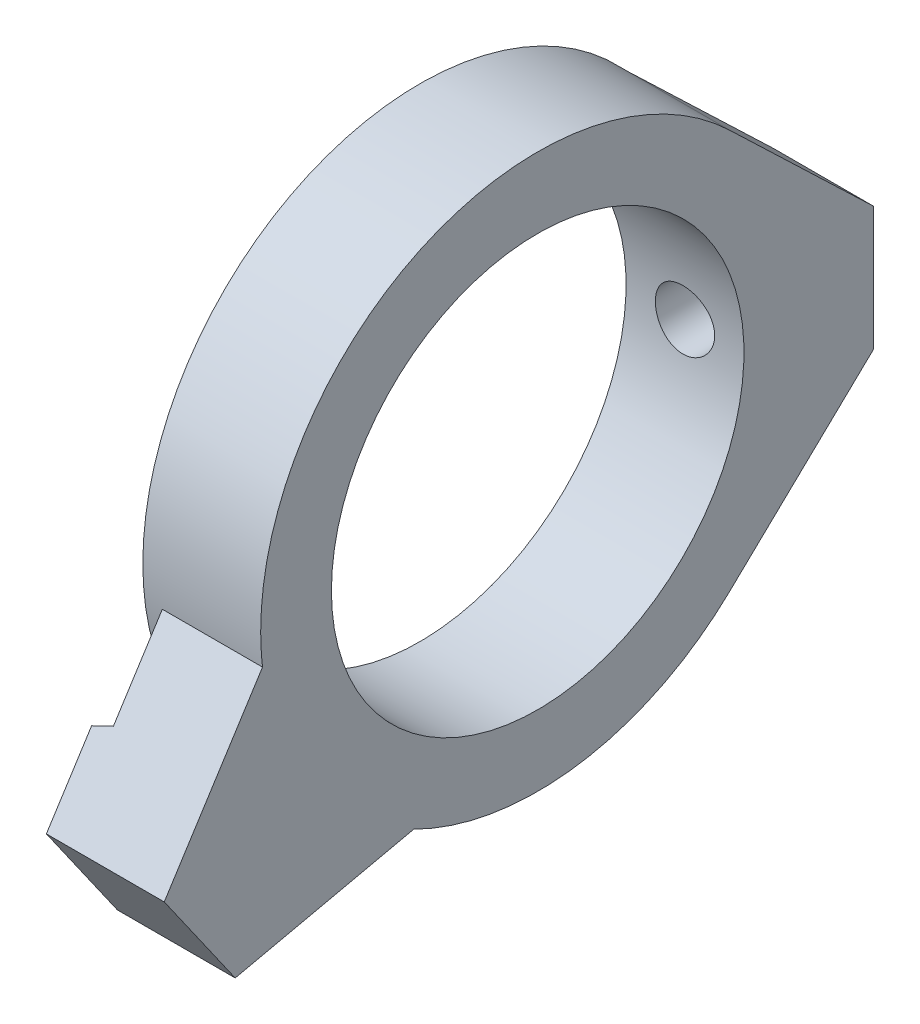
ISO-10303-21;
HEADER;
FILE_DESCRIPTION(('STEP AP214'),'2;1');
FILE_NAME('part.step','',(''),(''),'','','');
FILE_SCHEMA(('AUTOMOTIVE_DESIGN { 1 0 10303 214 1 1 1 1 }'));
ENDSEC;
DATA;
#1=APPLICATION_CONTEXT('core data for automotive mechanical design processes');
#2=APPLICATION_PROTOCOL_DEFINITION('international standard','automotive_design',2000,#1);
#3=PRODUCT_CONTEXT('',#1,'mechanical');
#4=PRODUCT('Part','Part','',(#3));
#5=PRODUCT_RELATED_PRODUCT_CATEGORY('part','',(#4));
#6=PRODUCT_DEFINITION_FORMATION('','',#4);
#7=PRODUCT_DEFINITION_CONTEXT('part definition',#1,'design');
#8=PRODUCT_DEFINITION('design','',#6,#7);
#9=PRODUCT_DEFINITION_SHAPE('','',#8);
#10=(LENGTH_UNIT() NAMED_UNIT(*) SI_UNIT(.MILLI.,.METRE.));
#11=(NAMED_UNIT(*) PLANE_ANGLE_UNIT() SI_UNIT($,.RADIAN.));
#12=(NAMED_UNIT(*) SI_UNIT($,.STERADIAN.) SOLID_ANGLE_UNIT());
#13=UNCERTAINTY_MEASURE_WITH_UNIT(LENGTH_MEASURE(1.E-05),#10,'distance_accuracy_value','');
#14=(GEOMETRIC_REPRESENTATION_CONTEXT(3) GLOBAL_UNCERTAINTY_ASSIGNED_CONTEXT((#13)) GLOBAL_UNIT_ASSIGNED_CONTEXT((#10,
#11,#12)) REPRESENTATION_CONTEXT('',''));
#15=CARTESIAN_POINT('',(0.,0.,0.));
#16=DIRECTION('',(0.,0.,1.));
#17=DIRECTION('',(1.,0.,0.));
#18=AXIS2_PLACEMENT_3D('',#15,#16,#17);
#19=CARTESIAN_POINT('',(124.,109.,-97.1));
#20=DIRECTION('',(-1.,0.,0.));
#21=DIRECTION('',(0.,-1.,0.));
#22=AXIS2_PLACEMENT_3D('',#19,#20,#21);
#23=CONICAL_SURFACE('',#22,29.5,0.321750554396647);
#24=CARTESIAN_POINT('',(125.5,109.,-97.1));
#25=DIRECTION('',(-1.,0.,0.));
#26=DIRECTION('',(0.,-1.,0.));
#27=AXIS2_PLACEMENT_3D('',#24,#25,#26);
#28=CIRCLE('',#27,29.);
#29=CARTESIAN_POINT('',(125.5,99.7908400248872,-69.6010659742458));
#30=VERTEX_POINT('',#29);
#31=CARTESIAN_POINT('',(125.5,86.309172831118,-79.0410309709572));
#32=VERTEX_POINT('',#31);
#33=EDGE_CURVE('E105',#30,#32,#28,.F.);
#34=ORIENTED_EDGE('',*,*,#33,.T.);
#35=CARTESIAN_POINT('',(125.5,86.309172831118,-79.0410309709572));
#36=CARTESIAN_POINT('',(124.76049302439,86.2405353199829,-78.7314271658099));
#37=CARTESIAN_POINT('',(124.,86.170714403484,-78.4164853640246));
#38=B_SPLINE_CURVE_WITH_KNOTS('',2,(#35,#36,#37),.UNSPECIFIED.,.F.,.F.,(3,3),(0.,1.),.UNSPECIFIED.);
#39=CARTESIAN_POINT('',(124.,86.170714403484,-78.4164853640246));
#40=VERTEX_POINT('',#39);
#41=EDGE_CURVE('E92',#40,#32,#38,.F.);
#42=ORIENTED_EDGE('',*,*,#41,.F.);
#43=CARTESIAN_POINT('',(124.,109.,-97.1));
#44=DIRECTION('',(-1.,0.,0.));
#45=DIRECTION('',(0.,-1.,0.));
#46=AXIS2_PLACEMENT_3D('',#43,#44,#45);
#47=CIRCLE('',#46,29.5);
#48=CARTESIAN_POINT('',(124.,99.2513146979725,-69.257350433516));
#49=VERTEX_POINT('',#48);
#50=EDGE_CURVE('E19',#49,#40,#47,.F.);
#51=ORIENTED_EDGE('',*,*,#50,.F.);
#52=CARTESIAN_POINT('',(124.,99.2513146979725,-69.257350433516));
#53=CARTESIAN_POINT('',(124.760493024394,99.5233830252203,-69.4306770737132));
#54=CARTESIAN_POINT('',(125.5,99.7908400248872,-69.6010659742458));
#55=B_SPLINE_CURVE_WITH_KNOTS('',2,(#52,#53,#54),.UNSPECIFIED.,.F.,.F.,(3,3),(0.,1.),.UNSPECIFIED.);
#56=EDGE_CURVE('E102',#30,#49,#55,.F.);
#57=ORIENTED_EDGE('',*,*,#56,.F.);
#58=EDGE_LOOP('',(#34,#42,#51,#57));
#59=FACE_BOUND('',#58,.T.);
#60=ADVANCED_FACE('F16',(#59),#23,.F.);
#61=CARTESIAN_POINT('',(124.,108.562138247598,-95.5092010795212));
#62=DIRECTION('',(-1.,0.,0.));
#63=DIRECTION('',(0.,0.,1.));
#64=AXIS2_PLACEMENT_3D('',#61,#62,#63);
#65=PLANE('',#64);
#66=DIRECTION('',(0.,0.819152044289003,0.57357643635103));
#67=VECTOR('',#66,1.);
#68=CARTESIAN_POINT('',(124.,84.624276495197,-71.4409547407282));
#69=LINE('',#68,#67);
#70=CARTESIAN_POINT('',(124.,84.624276495197,-71.4409547407282));
#71=VERTEX_POINT('',#70);
#72=CARTESIAN_POINT('',(124.,93.2253729602315,-65.4184021590424));
#73=VERTEX_POINT('',#72);
#74=EDGE_CURVE('E115',#71,#73,#69,.T.);
#75=ORIENTED_EDGE('',*,*,#74,.T.);
#76=DIRECTION('',(0.,0.843391445812876,-0.53729960834684));
#77=VECTOR('',#76,1.);
#78=CARTESIAN_POINT('',(124.,93.2253729602315,-65.4184021590424));
#79=LINE('',#78,#77);
#80=EDGE_CURVE('E201',#73,#49,#79,.T.);
#81=ORIENTED_EDGE('',*,*,#80,.T.);
#82=ORIENTED_EDGE('',*,*,#50,.T.);
#83=DIRECTION('',(0.,-0.216439613938084,0.976296007119938));
#84=VECTOR('',#83,1.);
#85=CARTESIAN_POINT('',(124.,87.982266672573,-86.5878695890335));
#86=LINE('',#85,#84);
#87=EDGE_CURVE('E101',#40,#71,#86,.T.);
#88=ORIENTED_EDGE('',*,*,#87,.T.);
#89=EDGE_LOOP('',(#75,#81,#82,#88));
#90=FACE_BOUND('',#89,.T.);
#91=ADVANCED_FACE('F283',(#90),#65,.T.);
#92=CARTESIAN_POINT('',(125.5,96.3097448101109,-78.0944677816397));
#93=DIRECTION('',(1.,0.,0.));
#94=DIRECTION('',(0.,0.,-1.));
#95=AXIS2_PLACEMENT_3D('',#92,#93,#94);
#96=PLANE('',#95);
#97=CARTESIAN_POINT('',(125.5,109.,-97.1));
#98=DIRECTION('',(-1.,0.,0.));
#99=DIRECTION('',(0.,0.,1.));
#100=AXIS2_PLACEMENT_3D('',#97,#98,#99);
#101=CIRCLE('',#100,23.5);
#102=CARTESIAN_POINT('',(125.5,87.982266672573,-86.5878695890335));
#103=VERTEX_POINT('',#102);
#104=CARTESIAN_POINT('',(125.5,106.310316789104,-73.7544307367538));
#105=VERTEX_POINT('',#104);
#106=EDGE_CURVE('E112',#103,#105,#101,.T.);
#107=ORIENTED_EDGE('',*,*,#106,.F.);
#108=DIRECTION('',(0.,-0.216439613938084,0.976296007119938));
#109=VECTOR('',#108,1.);
#110=CARTESIAN_POINT('',(125.5,87.982266672573,-86.5878695890335));
#111=LINE('',#110,#109);
#112=EDGE_CURVE('E98',#103,#32,#111,.T.);
#113=ORIENTED_EDGE('',*,*,#112,.T.);
#114=ORIENTED_EDGE('',*,*,#33,.F.);
#115=DIRECTION('',(0.,0.843391445812876,-0.53729960834684));
#116=VECTOR('',#115,1.);
#117=CARTESIAN_POINT('',(125.5,93.2253729602315,-65.4184021590424));
#118=LINE('',#117,#116);
#119=EDGE_CURVE('E150',#30,#105,#118,.T.);
#120=ORIENTED_EDGE('',*,*,#119,.T.);
#121=EDGE_LOOP('',(#107,#113,#114,#120));
#122=FACE_BOUND('',#121,.T.);
#123=ADVANCED_FACE('F111',(#122),#96,.F.);
#124=CARTESIAN_POINT('',(125.5,109.,-119.475011669298));
#125=DIRECTION('',(1.,0.,0.));
#126=DIRECTION('',(0.,0.,-1.));
#127=AXIS2_PLACEMENT_3D('',#124,#125,#126);
#128=PLANE('',#127);
#129=DIRECTION('',(0.,-0.691490354833863,0.722385692806646));
#130=VECTOR('',#129,1.);
#131=CARTESIAN_POINT('',(125.5,103.75,-125.6));
#132=LINE('',#131,#130);
#133=CARTESIAN_POINT('',(125.5,103.75,-125.6));
#134=VERTEX_POINT('',#133);
#135=CARTESIAN_POINT('',(125.5,92.0239362190439,-113.350023338596));
#136=VERTEX_POINT('',#135);
#137=EDGE_CURVE('E109',#134,#136,#132,.T.);
#138=ORIENTED_EDGE('',*,*,#137,.T.);
#139=CARTESIAN_POINT('',(125.5,109.,-97.1));
#140=DIRECTION('',(-1.,0.,0.));
#141=DIRECTION('',(0.,0.,1.));
#142=AXIS2_PLACEMENT_3D('',#139,#140,#141);
#143=CIRCLE('',#142,23.5);
#144=CARTESIAN_POINT('',(125.5,125.976063780956,-113.350023338596));
#145=VERTEX_POINT('',#144);
#146=EDGE_CURVE('E127',#145,#136,#143,.T.);
#147=ORIENTED_EDGE('',*,*,#146,.F.);
#148=DIRECTION('',(0.,-0.691490354833863,-0.722385692806646));
#149=VECTOR('',#148,1.);
#150=CARTESIAN_POINT('',(125.5,125.976063780956,-113.350023338596));
#151=LINE('',#150,#149);
#152=CARTESIAN_POINT('',(125.5,114.25,-125.6));
#153=VERTEX_POINT('',#152);
#154=EDGE_CURVE('E132',#145,#153,#151,.T.);
#155=ORIENTED_EDGE('',*,*,#154,.T.);
#156=DIRECTION('',(0.,-1.,0.));
#157=VECTOR('',#156,1.);
#158=CARTESIAN_POINT('',(125.5,114.25,-125.6));
#159=LINE('',#158,#157);
#160=EDGE_CURVE('E139',#153,#134,#159,.T.);
#161=ORIENTED_EDGE('',*,*,#160,.T.);
#162=EDGE_LOOP('',(#138,#147,#155,#161));
#163=FACE_BOUND('',#162,.T.);
#164=ADVANCED_FACE('F264',(#163),#128,.F.);
#165=CARTESIAN_POINT('',(124.,103.75,-125.6));
#166=DIRECTION('',(0.,0.722385692806646,0.691490354833863));
#167=DIRECTION('',(0.,-0.691490354833863,0.722385692806646));
#168=AXIS2_PLACEMENT_3D('',#165,#166,#167);
#169=PLANE('',#168);
#170=DIRECTION('',(1.,0.,0.));
#171=VECTOR('',#170,1.);
#172=CARTESIAN_POINT('',(124.,103.75,-125.6));
#173=LINE('',#172,#171);
#174=CARTESIAN_POINT('',(134.,103.75,-125.6));
#175=VERTEX_POINT('',#174);
#176=EDGE_CURVE('E129',#134,#175,#173,.T.);
#177=ORIENTED_EDGE('',*,*,#176,.T.);
#178=DIRECTION('',(0.,-0.691490354833871,0.722385692806639));
#179=VECTOR('',#178,1.);
#180=CARTESIAN_POINT('',(134.,103.75,-125.6));
#181=LINE('',#180,#179);
#182=CARTESIAN_POINT('',(134.,92.0239362190439,-113.350023338596));
#183=VERTEX_POINT('',#182);
#184=EDGE_CURVE('E196',#175,#183,#181,.T.);
#185=ORIENTED_EDGE('',*,*,#184,.T.);
#186=DIRECTION('',(-1.,0.,0.));
#187=VECTOR('',#186,1.);
#188=CARTESIAN_POINT('',(124.,92.0239362190439,-113.350023338596));
#189=LINE('',#188,#187);
#190=EDGE_CURVE('E124',#136,#183,#189,.F.);
#191=ORIENTED_EDGE('',*,*,#190,.F.);
#192=ORIENTED_EDGE('',*,*,#137,.F.);
#193=EDGE_LOOP('',(#177,#185,#191,#192));
#194=FACE_BOUND('',#193,.T.);
#195=ADVANCED_FACE('F268',(#194),#169,.F.);
#196=CARTESIAN_POINT('',(124.,87.982266672573,-86.5878695890335));
#197=DIRECTION('',(0.,0.976296007119938,0.216439613938084));
#198=DIRECTION('',(0.,-0.216439613938084,0.976296007119938));
#199=AXIS2_PLACEMENT_3D('',#196,#197,#198);
#200=PLANE('',#199);
#201=ORIENTED_EDGE('',*,*,#112,.F.);
#202=DIRECTION('',(-1.,0.,0.));
#203=VECTOR('',#202,1.);
#204=CARTESIAN_POINT('',(124.,87.982266672573,-86.5878695890335));
#205=LINE('',#204,#203);
#206=CARTESIAN_POINT('',(134.,87.982266672573,-86.5878695890336));
#207=VERTEX_POINT('',#206);
#208=EDGE_CURVE('E126',#207,#103,#205,.T.);
#209=ORIENTED_EDGE('',*,*,#208,.F.);
#210=DIRECTION('',(0.,-0.21643961393808,0.976296007119938));
#211=VECTOR('',#210,1.);
#212=CARTESIAN_POINT('',(134.,87.982266672573,-86.5878695890335));
#213=LINE('',#212,#211);
#214=CARTESIAN_POINT('',(134.,84.624276495197,-71.4409547407282));
#215=VERTEX_POINT('',#214);
#216=EDGE_CURVE('E195',#207,#215,#213,.T.);
#217=ORIENTED_EDGE('',*,*,#216,.T.);
#218=DIRECTION('',(1.,0.,0.));
#219=VECTOR('',#218,1.);
#220=CARTESIAN_POINT('',(124.,84.624276495197,-71.4409547407282));
#221=LINE('',#220,#219);
#222=EDGE_CURVE('E113',#215,#71,#221,.F.);
#223=ORIENTED_EDGE('',*,*,#222,.T.);
#224=ORIENTED_EDGE('',*,*,#87,.F.);
#225=ORIENTED_EDGE('',*,*,#41,.T.);
#226=EDGE_LOOP('',(#201,#209,#217,#223,#224,#225));
#227=FACE_BOUND('',#226,.T.);
#228=ADVANCED_FACE('F96',(#227),#200,.F.);
#229=CARTESIAN_POINT('',(124.,84.624276495197,-71.4409547407282));
#230=DIRECTION('',(0.,0.57357643635103,-0.819152044289003));
#231=DIRECTION('',(0.,0.819152044289003,0.57357643635103));
#232=AXIS2_PLACEMENT_3D('',#229,#230,#231);
#233=PLANE('',#232);
#234=ORIENTED_EDGE('',*,*,#222,.F.);
#235=DIRECTION('',(0.,0.819152044289003,0.57357643635103));
#236=VECTOR('',#235,1.);
#237=CARTESIAN_POINT('',(134.,84.624276495197,-71.4409547407282));
#238=LINE('',#237,#236);
#239=CARTESIAN_POINT('',(134.,93.2253729602315,-65.4184021590424));
#240=VERTEX_POINT('',#239);
#241=EDGE_CURVE('E221',#215,#240,#238,.T.);
#242=ORIENTED_EDGE('',*,*,#241,.T.);
#243=DIRECTION('',(1.,0.,0.));
#244=VECTOR('',#243,1.);
#245=CARTESIAN_POINT('',(124.,93.2253729602315,-65.4184021590424));
#246=LINE('',#245,#244);
#247=EDGE_CURVE('E205',#240,#73,#246,.F.);
#248=ORIENTED_EDGE('',*,*,#247,.T.);
#249=ORIENTED_EDGE('',*,*,#74,.F.);
#250=EDGE_LOOP('',(#234,#242,#248,#249));
#251=FACE_BOUND('',#250,.T.);
#252=ADVANCED_FACE('F277',(#251),#233,.F.);
#253=CARTESIAN_POINT('',(124.,93.2253729602315,-65.4184021590424));
#254=DIRECTION('',(0.,-0.53729960834684,-0.843391445812876));
#255=DIRECTION('',(0.,0.843391445812876,-0.53729960834684));
#256=AXIS2_PLACEMENT_3D('',#253,#254,#255);
#257=PLANE('',#256);
#258=ORIENTED_EDGE('',*,*,#80,.F.);
#259=ORIENTED_EDGE('',*,*,#247,.F.);
#260=DIRECTION('',(0.,0.84339144581288,-0.537299608346833));
#261=VECTOR('',#260,1.);
#262=CARTESIAN_POINT('',(134.,93.2253729602315,-65.4184021590424));
#263=LINE('',#262,#261);
#264=CARTESIAN_POINT('',(134.,106.310316789104,-73.7544307367538));
#265=VERTEX_POINT('',#264);
#266=EDGE_CURVE('E191',#240,#265,#263,.T.);
#267=ORIENTED_EDGE('',*,*,#266,.T.);
#268=DIRECTION('',(-1.,0.,0.));
#269=VECTOR('',#268,1.);
#270=CARTESIAN_POINT('',(124.,106.310316789104,-73.7544307367538));
#271=LINE('',#270,#269);
#272=EDGE_CURVE('E200',#105,#265,#271,.F.);
#273=ORIENTED_EDGE('',*,*,#272,.F.);
#274=ORIENTED_EDGE('',*,*,#119,.F.);
#275=ORIENTED_EDGE('',*,*,#56,.T.);
#276=EDGE_LOOP('',(#258,#259,#267,#273,#274,#275));
#277=FACE_BOUND('',#276,.T.);
#278=ADVANCED_FACE('F253',(#277),#257,.F.);
#279=CARTESIAN_POINT('',(124.,109.,-97.1));
#280=DIRECTION('',(-1.,0.,0.));
#281=DIRECTION('',(0.,0.,1.));
#282=AXIS2_PLACEMENT_3D('',#279,#280,#281);
#283=CYLINDRICAL_SURFACE('',#282,23.5);
#284=CARTESIAN_POINT('',(124.,109.,-97.1));
#285=DIRECTION('',(-1.,0.,0.));
#286=DIRECTION('',(0.,0.,1.));
#287=AXIS2_PLACEMENT_3D('',#284,#285,#286);
#288=CIRCLE('',#287,23.5);
#289=CARTESIAN_POINT('',(124.,109.,-73.6));
#290=VERTEX_POINT('',#289);
#291=EDGE_CURVE('E142',#290,#290,#288,.T.);
#292=ORIENTED_EDGE('',*,*,#291,.F.);
#293=EDGE_LOOP('',(#292));
#294=FACE_BOUND('',#293,.T.);
#295=ORIENTED_EDGE('',*,*,#272,.T.);
#296=CARTESIAN_POINT('',(134.,109.,-97.1));
#297=DIRECTION('',(-1.,0.,0.));
#298=DIRECTION('',(0.,0.,1.));
#299=AXIS2_PLACEMENT_3D('',#296,#297,#298);
#300=CIRCLE('',#299,23.5);
#301=CARTESIAN_POINT('',(134.,125.976063780956,-113.350023338596));
#302=VERTEX_POINT('',#301);
#303=EDGE_CURVE('E187',#265,#302,#300,.T.);
#304=ORIENTED_EDGE('',*,*,#303,.T.);
#305=DIRECTION('',(1.,0.,0.));
#306=VECTOR('',#305,1.);
#307=CARTESIAN_POINT('',(124.,125.976063780956,-113.350023338596));
#308=LINE('',#307,#306);
#309=EDGE_CURVE('E136',#302,#145,#308,.F.);
#310=ORIENTED_EDGE('',*,*,#309,.T.);
#311=ORIENTED_EDGE('',*,*,#146,.T.);
#312=ORIENTED_EDGE('',*,*,#190,.T.);
#313=CARTESIAN_POINT('',(134.,109.,-97.1));
#314=DIRECTION('',(-1.,0.,0.));
#315=DIRECTION('',(0.,0.,1.));
#316=AXIS2_PLACEMENT_3D('',#313,#314,#315);
#317=CIRCLE('',#316,23.5);
#318=EDGE_CURVE('E192',#183,#207,#317,.T.);
#319=ORIENTED_EDGE('',*,*,#318,.T.);
#320=ORIENTED_EDGE('',*,*,#208,.T.);
#321=ORIENTED_EDGE('',*,*,#106,.T.);
#322=EDGE_LOOP('',(#295,#304,#310,#311,#312,#319,#320,#321));
#323=FACE_BOUND('',#322,.T.);
#324=ADVANCED_FACE('F250',(#294,#323),#283,.T.);
#325=CARTESIAN_POINT('',(124.,125.976063780956,-113.350023338596));
#326=DIRECTION('',(0.,-0.722385692806646,0.691490354833863));
#327=DIRECTION('',(0.,-0.691490354833863,-0.722385692806646));
#328=AXIS2_PLACEMENT_3D('',#325,#326,#327);
#329=PLANE('',#328);
#330=ORIENTED_EDGE('',*,*,#309,.F.);
#331=DIRECTION('',(0.,-0.691490354833865,-0.722385692806645));
#332=VECTOR('',#331,1.);
#333=CARTESIAN_POINT('',(134.,125.976063780956,-113.350023338596));
#334=LINE('',#333,#332);
#335=CARTESIAN_POINT('',(134.,114.25,-125.6));
#336=VERTEX_POINT('',#335);
#337=EDGE_CURVE('E190',#302,#336,#334,.T.);
#338=ORIENTED_EDGE('',*,*,#337,.T.);
#339=DIRECTION('',(1.,0.,0.));
#340=VECTOR('',#339,1.);
#341=CARTESIAN_POINT('',(124.,114.25,-125.6));
#342=LINE('',#341,#340);
#343=EDGE_CURVE('E34',#336,#153,#342,.F.);
#344=ORIENTED_EDGE('',*,*,#343,.T.);
#345=ORIENTED_EDGE('',*,*,#154,.F.);
#346=EDGE_LOOP('',(#330,#338,#344,#345));
#347=FACE_BOUND('',#346,.T.);
#348=ADVANCED_FACE('F261',(#347),#329,.F.);
#349=CARTESIAN_POINT('',(124.,114.25,-125.6));
#350=DIRECTION('',(0.,0.,1.));
#351=DIRECTION('',(0.,-1.,0.));
#352=AXIS2_PLACEMENT_3D('',#349,#350,#351);
#353=PLANE('',#352);
#354=CARTESIAN_POINT('',(129.,109.,-125.6));
#355=DIRECTION('',(0.,0.,-1.));
#356=DIRECTION('',(0.,1.,0.));
#357=AXIS2_PLACEMENT_3D('',#354,#355,#356);
#358=CIRCLE('',#357,2.5175);
#359=CARTESIAN_POINT('',(129.,111.5175,-125.6));
#360=VERTEX_POINT('',#359);
#361=EDGE_CURVE('E181',#360,#360,#358,.F.);
#362=ORIENTED_EDGE('',*,*,#361,.T.);
#363=EDGE_LOOP('',(#362));
#364=FACE_BOUND('',#363,.T.);
#365=ORIENTED_EDGE('',*,*,#343,.F.);
#366=DIRECTION('',(0.,1.,0.));
#367=VECTOR('',#366,1.);
#368=CARTESIAN_POINT('',(134.,108.562138247598,-125.6));
#369=LINE('',#368,#367);
#370=EDGE_CURVE('E184',#336,#175,#369,.F.);
#371=ORIENTED_EDGE('',*,*,#370,.T.);
#372=ORIENTED_EDGE('',*,*,#176,.F.);
#373=ORIENTED_EDGE('',*,*,#160,.F.);
#374=EDGE_LOOP('',(#365,#371,#372,#373));
#375=FACE_BOUND('',#374,.T.);
#376=ADVANCED_FACE('F266',(#364,#375),#353,.F.);
#377=CARTESIAN_POINT('',(124.,108.562138247598,-95.5092010795212));
#378=DIRECTION('',(-1.,0.,0.));
#379=DIRECTION('',(0.,0.,1.));
#380=AXIS2_PLACEMENT_3D('',#377,#378,#379);
#381=PLANE('',#380);
#382=CARTESIAN_POINT('',(124.,109.,-97.1));
#383=DIRECTION('',(-1.,0.,0.));
#384=DIRECTION('',(0.,0.,1.));
#385=AXIS2_PLACEMENT_3D('',#382,#383,#384);
#386=CIRCLE('',#385,17.5);
#387=CARTESIAN_POINT('',(124.,109.,-79.6));
#388=VERTEX_POINT('',#387);
#389=EDGE_CURVE('E175',#388,#388,#386,.F.);
#390=ORIENTED_EDGE('',*,*,#389,.T.);
#391=EDGE_LOOP('',(#390));
#392=FACE_BOUND('',#391,.T.);
#393=ORIENTED_EDGE('',*,*,#291,.T.);
#394=EDGE_LOOP('',(#393));
#395=FACE_BOUND('',#394,.T.);
#396=ADVANCED_FACE('F302',(#392,#395),#381,.T.);
#397=CARTESIAN_POINT('',(134.,108.562138247598,-95.5092010795212));
#398=DIRECTION('',(-1.,0.,0.));
#399=DIRECTION('',(0.,0.,1.));
#400=AXIS2_PLACEMENT_3D('',#397,#398,#399);
#401=PLANE('',#400);
#402=CARTESIAN_POINT('',(134.,109.,-97.1));
#403=DIRECTION('',(-1.,0.,0.));
#404=DIRECTION('',(0.,0.,1.));
#405=AXIS2_PLACEMENT_3D('',#402,#403,#404);
#406=CIRCLE('',#405,17.5);
#407=CARTESIAN_POINT('',(134.,109.,-79.6));
#408=VERTEX_POINT('',#407);
#409=EDGE_CURVE('E25',#408,#408,#406,.T.);
#410=ORIENTED_EDGE('',*,*,#409,.T.);
#411=EDGE_LOOP('',(#410));
#412=FACE_BOUND('',#411,.T.);
#413=ORIENTED_EDGE('',*,*,#337,.F.);
#414=ORIENTED_EDGE('',*,*,#303,.F.);
#415=ORIENTED_EDGE('',*,*,#266,.F.);
#416=ORIENTED_EDGE('',*,*,#241,.F.);
#417=ORIENTED_EDGE('',*,*,#216,.F.);
#418=ORIENTED_EDGE('',*,*,#318,.F.);
#419=ORIENTED_EDGE('',*,*,#184,.F.);
#420=ORIENTED_EDGE('',*,*,#370,.F.);
#421=EDGE_LOOP('',(#413,#414,#415,#416,#417,#418,#419,#420));
#422=FACE_BOUND('',#421,.T.);
#423=ADVANCED_FACE('F170',(#412,#422),#401,.F.);
#424=CARTESIAN_POINT('',(129.,109.,-100.3));
#425=DIRECTION('',(0.,0.,-1.));
#426=DIRECTION('',(0.,1.,0.));
#427=AXIS2_PLACEMENT_3D('',#424,#425,#426);
#428=CYLINDRICAL_SURFACE('',#427,2.5175);
#429=CARTESIAN_POINT('',(126.4825,109.,-114.6));
#430=CARTESIAN_POINT('',(126.482506068437,108.859377778917,-114.599997734113));
#431=CARTESIAN_POINT('',(126.494322678485,108.71866642915,-114.598287132188));
#432=CARTESIAN_POINT('',(126.54126970569,108.441165677091,-114.591627386495));
#433=CARTESIAN_POINT('',(126.576424817938,108.304380589394,-114.586674812388));
#434=CARTESIAN_POINT('',(126.66898056331,108.038798649969,-114.574088122237));
#435=CARTESIAN_POINT('',(126.726364277353,107.909995808918,-114.566456046081));
#436=CARTESIAN_POINT('',(126.861708545945,107.663870726814,-114.549355220547));
#437=CARTESIAN_POINT('',(126.939665768194,107.546546630759,-114.539886768673));
#438=CARTESIAN_POINT('',(127.114544355883,107.325839573132,-114.520090751489));
#439=CARTESIAN_POINT('',(127.211584800797,107.222551416266,-114.509758038646));
#440=CARTESIAN_POINT('',(127.421619269152,107.033665715356,-114.489438645394));
#441=CARTESIAN_POINT('',(127.534614221783,106.948069202389,-114.479451985183));
#442=CARTESIAN_POINT('',(127.773981088493,106.79663219651,-114.460905441451));
#443=CARTESIAN_POINT('',(127.900411066236,106.730882597278,-114.452352199739));
#444=CARTESIAN_POINT('',(128.162662925725,106.621586591674,-114.437710604838));
#445=CARTESIAN_POINT('',(128.298484334167,106.578039067299,-114.431622127538));
#446=CARTESIAN_POINT('',(128.574670569477,106.514675930557,-114.422649669895));
#447=CARTESIAN_POINT('',(128.714997593977,106.494698690588,-114.419743875045));
#448=CARTESIAN_POINT('',(128.997040005977,106.478542646379,-114.417399445267));
#449=CARTESIAN_POINT('',(129.138755319584,106.482362582276,-114.417960626791));
#450=CARTESIAN_POINT('',(129.41841381331,106.513560212019,-114.422466787687));
#451=CARTESIAN_POINT('',(129.556377492285,106.540758410838,-114.426385983963));
#452=CARTESIAN_POINT('',(129.825762339179,106.61765977261,-114.437126324296));
#453=CARTESIAN_POINT('',(129.957183335213,106.66736352647,-114.443947544548));
#454=CARTESIAN_POINT('',(130.210301382646,106.788053405451,-114.459752037046));
#455=CARTESIAN_POINT('',(130.331961433004,106.859116074602,-114.468743062));
#456=CARTESIAN_POINT('',(130.561698141559,107.020451998179,-114.487868406108));
#457=CARTESIAN_POINT('',(130.669773978754,107.110726412838,-114.498002794294));
#458=CARTESIAN_POINT('',(130.870315093476,107.308911036194,-114.518387087563));
#459=CARTESIAN_POINT('',(130.962627804484,107.416975673469,-114.528637198424));
#460=CARTESIAN_POINT('',(131.127829414063,107.647145455862,-114.548011368552));
#461=CARTESIAN_POINT('',(131.200718238161,107.76925065481,-114.557135423501));
#462=CARTESIAN_POINT('',(131.325008828863,108.024163856595,-114.573237899232));
#463=CARTESIAN_POINT('',(131.376399405757,108.15697739027,-114.580215202144));
#464=CARTESIAN_POINT('',(131.456105100331,108.42947204502,-114.591228502769));
#465=CARTESIAN_POINT('',(131.48442165485,108.569152737898,-114.595264683627));
#466=CARTESIAN_POINT('',(131.516973988708,108.850099325391,-114.599916890752));
#467=CARTESIAN_POINT('',(131.521419624264,108.991340429651,-114.60056272145));
#468=CARTESIAN_POINT('',(131.506660107449,109.272551994631,-114.598442418531));
#469=CARTESIAN_POINT('',(131.487455624713,109.412522491214,-114.595676381519));
#470=CARTESIAN_POINT('',(131.426115499418,109.686588138752,-114.587061591324));
#471=CARTESIAN_POINT('',(131.384081542477,109.82070651512,-114.581226511693));
#472=CARTESIAN_POINT('',(131.27838243974,110.079991939324,-114.567126030172));
#473=CARTESIAN_POINT('',(131.214716324251,110.20515858558,-114.558860519336));
#474=CARTESIAN_POINT('',(131.067063432044,110.443914461156,-114.540744247737));
#475=CARTESIAN_POINT('',(130.982942759246,110.557420090544,-114.530883190972));
#476=CARTESIAN_POINT('',(130.796956978622,110.768776381682,-114.510707143564));
#477=CARTESIAN_POINT('',(130.695091095581,110.866626359144,-114.500392133105));
#478=CARTESIAN_POINT('',(130.475575695528,111.044651975086,-114.480377015853));
#479=CARTESIAN_POINT('',(130.357812175764,111.124687729773,-114.470682174378));
#480=CARTESIAN_POINT('',(130.110386006469,111.263845366063,-114.453096094775));
#481=CARTESIAN_POINT('',(129.980723045922,111.322966700829,-114.445204903808));
#482=CARTESIAN_POINT('',(129.711458171594,111.419158443763,-114.432053493872));
#483=CARTESIAN_POINT('',(129.571751053762,111.455939649693,-114.426827915311));
#484=CARTESIAN_POINT('',(129.28802686362,111.505109325384,-114.419787981899));
#485=CARTESIAN_POINT('',(129.144010051698,111.517499265838,-114.417973421379));
#486=CARTESIAN_POINT('',(128.859253165755,111.517500717527,-114.417972869121));
#487=CARTESIAN_POINT('',(128.718512788836,111.505667337575,-114.419705586988));
#488=CARTESIAN_POINT('',(128.44106371086,111.458697006452,-114.426435420219));
#489=CARTESIAN_POINT('',(128.304354839809,111.423561039331,-114.431432397737));
#490=CARTESIAN_POINT('',(128.038870384643,111.331049601263,-114.444116302564));
#491=CARTESIAN_POINT('',(127.910092330344,111.273681096019,-114.451802387274));
#492=CARTESIAN_POINT('',(127.663984087384,111.13836148912,-114.468996570357));
#493=CARTESIAN_POINT('',(127.546654224849,111.060409801343,-114.478504720613));
#494=CARTESIAN_POINT('',(127.325938727665,110.885543946099,-114.498347481187));
#495=CARTESIAN_POINT('',(127.222647306196,110.788511420608,-114.508686998889));
#496=CARTESIAN_POINT('',(127.033734481171,110.578467592979,-114.528985889965));
#497=CARTESIAN_POINT('',(126.948117298191,110.465452485062,-114.538945172076));
#498=CARTESIAN_POINT('',(126.796621209939,110.226010902877,-114.557416028799));
#499=CARTESIAN_POINT('',(126.730840148804,110.099521982275,-114.565920340287));
#500=CARTESIAN_POINT('',(126.621559027296,109.837236045078,-114.580452411523));
#501=CARTESIAN_POINT('',(126.578034101824,109.701449609138,-114.586482933553));
#502=CARTESIAN_POINT('',(126.525095453353,109.470775464373,-114.593911286647));
#503=CARTESIAN_POINT('',(126.509145259224,109.377363499053,-114.596183551084));
#504=CARTESIAN_POINT('',(126.487845539737,109.189314482096,-114.599228663463));
#505=CARTESIAN_POINT('',(126.482495914273,109.094677442037,-114.600001525565));
#506=CARTESIAN_POINT('',(126.4825,109.,-114.6));
#507=B_SPLINE_CURVE_WITH_KNOTS('',3,(#429,#430,#431,#432,#433,#434,#435,#436,#437,#438,#439,
#440,#441,#442,#443,#444,#445,#446,#447,#448,#449,#450,#451,#452,#453,#454,#455,#456,#457,#458,
#459,#460,#461,#462,#463,#464,#465,#466,#467,#468,#469,#470,#471,#472,#473,#474,#475,#476,#477,
#478,#479,#480,#481,#482,#483,#484,#485,#486,#487,#488,#489,#490,#491,#492,#493,#494,#495,#496,
#497,#498,#499,#500,#501,#502,#503,#504,#505,#506),.UNSPECIFIED.,.T.,.F.,(4,2,2,2,2,2,2,2,2,2,2,
2,2,2,2,2,2,2,2,2,2,2,2,2,2,2,2,2,2,2,2,2,2,2,2,2,2,2,4),(0.,0.421520037920441,
0.843486809848201,1.26513303504324,1.68671100790172,2.1110082518055,2.53533021697801,
2.96156696945246,3.38778225631702,3.8110575659672,4.23431046687153,4.65434242632529,
5.0743854148061,5.49595203429043,5.91754412021052,6.34301010582388,6.76847772268364,
7.19416651821309,7.61982880373128,8.04174276609257,8.46364478257195,8.88368281940228,
9.30373968756239,9.72662400578083,10.1495268026955,10.5756416083109,11.0017675544404,
11.4332984208435,11.8648032669299,12.2865303639781,12.7082396529528,13.1298169223839,
13.551406197833,13.975698128468,14.4000912623246,14.8265447570215,15.2525207607387,
15.5363223927532,15.820121344654),.UNSPECIFIED.);
#508=CARTESIAN_POINT('',(126.4825,109.,-114.6));
#509=VERTEX_POINT('',#508);
#510=EDGE_CURVE('E11',#509,#509,#507,.T.);
#511=ORIENTED_EDGE('',*,*,#510,.T.);
#512=EDGE_LOOP('',(#511));
#513=FACE_BOUND('',#512,.T.);
#514=ORIENTED_EDGE('',*,*,#361,.F.);
#515=EDGE_LOOP('',(#514));
#516=FACE_BOUND('',#515,.T.);
#517=ADVANCED_FACE('F159',(#513,#516),#428,.F.);
#518=CARTESIAN_POINT('',(124.,109.,-97.1));
#519=DIRECTION('',(-1.,0.,0.));
#520=DIRECTION('',(0.,0.,1.));
#521=AXIS2_PLACEMENT_3D('',#518,#519,#520);
#522=CYLINDRICAL_SURFACE('',#521,17.5);
#523=ORIENTED_EDGE('',*,*,#389,.F.);
#524=EDGE_LOOP('',(#523));
#525=FACE_BOUND('',#524,.T.);
#526=ORIENTED_EDGE('',*,*,#510,.F.);
#527=EDGE_LOOP('',(#526));
#528=FACE_BOUND('',#527,.T.);
#529=ORIENTED_EDGE('',*,*,#409,.F.);
#530=EDGE_LOOP('',(#529));
#531=FACE_BOUND('',#530,.T.);
#532=ADVANCED_FACE('F162',(#525,#528,#531),#522,.F.);
#533=CLOSED_SHELL('',(#60,#91,#123,#164,#195,#228,#252,#278,#324,#348,#376,#396,#423,#517,#532));
#534=MANIFOLD_SOLID_BREP('B1',#533);
#535=ADVANCED_BREP_SHAPE_REPRESENTATION('',(#18,#534),#14);
#536=SHAPE_DEFINITION_REPRESENTATION(#9,#535);
ENDSEC;
END-ISO-10303-21;
